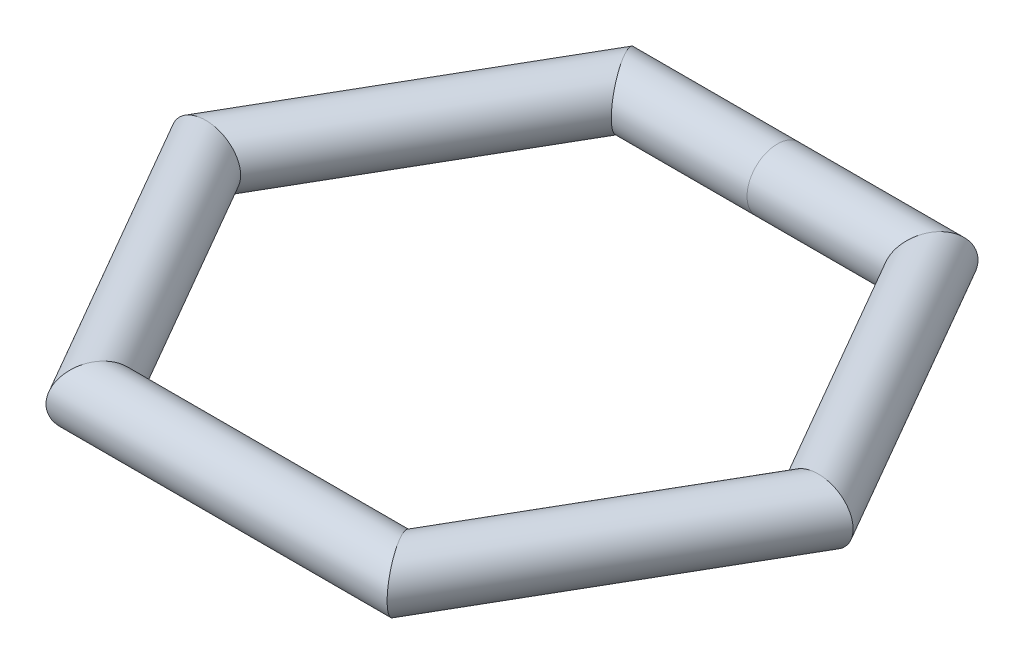
ISO-10303-21;
HEADER;
FILE_DESCRIPTION(('STEP AP214'),'2;1');
FILE_NAME('part.step','',(''),(''),'','','');
FILE_SCHEMA(('AUTOMOTIVE_DESIGN { 1 0 10303 214 1 1 1 1 }'));
ENDSEC;
DATA;
#1=APPLICATION_CONTEXT('core data for automotive mechanical design processes');
#2=APPLICATION_PROTOCOL_DEFINITION('international standard','automotive_design',2000,#1);
#3=PRODUCT_CONTEXT('',#1,'mechanical');
#4=PRODUCT('Part','Part','',(#3));
#5=PRODUCT_RELATED_PRODUCT_CATEGORY('part','',(#4));
#6=PRODUCT_DEFINITION_FORMATION('','',#4);
#7=PRODUCT_DEFINITION_CONTEXT('part definition',#1,'design');
#8=PRODUCT_DEFINITION('design','',#6,#7);
#9=PRODUCT_DEFINITION_SHAPE('','',#8);
#10=(LENGTH_UNIT() NAMED_UNIT(*) SI_UNIT(.MILLI.,.METRE.));
#11=(NAMED_UNIT(*) PLANE_ANGLE_UNIT() SI_UNIT($,.RADIAN.));
#12=(NAMED_UNIT(*) SI_UNIT($,.STERADIAN.) SOLID_ANGLE_UNIT());
#13=UNCERTAINTY_MEASURE_WITH_UNIT(LENGTH_MEASURE(1.E-05),#10,'distance_accuracy_value','');
#14=(GEOMETRIC_REPRESENTATION_CONTEXT(3) GLOBAL_UNCERTAINTY_ASSIGNED_CONTEXT((#13)) GLOBAL_UNIT_ASSIGNED_CONTEXT((#10,
#11,#12)) REPRESENTATION_CONTEXT('',''));
#15=CARTESIAN_POINT('',(0.,0.,0.));
#16=DIRECTION('',(0.,0.,1.));
#17=DIRECTION('',(1.,0.,0.));
#18=AXIS2_PLACEMENT_3D('',#15,#16,#17);
#19=CARTESIAN_POINT('',(-38.4706617480043,0.,75.7243798637072));
#20=DIRECTION('',(-0.5,0.,-0.866025403784438));
#21=DIRECTION('',(-0.866025403784439,0.,0.5));
#22=AXIS2_PLACEMENT_3D('',#19,#20,#21);
#23=CYLINDRICAL_SURFACE('',#22,8.10730366782764);
#24=CARTESIAN_POINT('',(-41.0950764232666,0.,71.1787603060236));
#25=DIRECTION('',(-0.866025403784439,0.,-0.5));
#26=DIRECTION('',(-0.5,0.,0.866025403784439));
#27=AXIS2_PLACEMENT_3D('',#24,#25,#26);
#28=ELLIPSE('',#27,9.36150791004466,8.10730366782764);
#29=CARTESIAN_POINT('',(-45.7758303782889,0.,79.2860639738512));
#30=VERTEX_POINT('',#29);
#31=EDGE_CURVE('E64',#30,#30,#28,.F.);
#32=ORIENTED_EDGE('',*,*,#31,.F.);
#33=EDGE_LOOP('',(#32));
#34=FACE_BOUND('',#33,.T.);
#35=CARTESIAN_POINT('',(-82.1901528465331,0.,0.));
#36=DIRECTION('',(0.,0.,-1.));
#37=DIRECTION('',(1.,0.,0.));
#38=AXIS2_PLACEMENT_3D('',#35,#36,#37);
#39=ELLIPSE('',#38,9.36150791004466,8.10730366782764);
#40=CARTESIAN_POINT('',(-72.8286449364885,0.,0.));
#41=VERTEX_POINT('',#40);
#42=EDGE_CURVE('E40',#41,#41,#39,.F.);
#43=ORIENTED_EDGE('',*,*,#42,.T.);
#44=EDGE_LOOP('',(#43));
#45=FACE_BOUND('',#44,.T.);
#46=ADVANCED_FACE('F37',(#34,#45),#23,.T.);
#47=CARTESIAN_POINT('',(-84.8145675217954,0.,4.54561955768364));
#48=DIRECTION('',(0.5,0.,-0.866025403784439));
#49=DIRECTION('',(-0.866025403784439,0.,-0.5));
#50=AXIS2_PLACEMENT_3D('',#47,#48,#49);
#51=CYLINDRICAL_SURFACE('',#50,8.10730366782764);
#52=ORIENTED_EDGE('',*,*,#42,.F.);
#53=EDGE_LOOP('',(#52));
#54=FACE_BOUND('',#53,.T.);
#55=CARTESIAN_POINT('',(-41.0950764232666,0.,-71.1787603060236));
#56=DIRECTION('',(0.866025403784438,0.,-0.5));
#57=DIRECTION('',(0.5,0.,0.866025403784439));
#58=AXIS2_PLACEMENT_3D('',#55,#56,#57);
#59=ELLIPSE('',#58,9.36150791004466,8.10730366782764);
#60=CARTESIAN_POINT('',(-36.4143224682443,0.,-63.0714566381959));
#61=VERTEX_POINT('',#60);
#62=EDGE_CURVE('E57',#61,#61,#59,.F.);
#63=ORIENTED_EDGE('',*,*,#62,.T.);
#64=EDGE_LOOP('',(#63));
#65=FACE_BOUND('',#64,.T.);
#66=ADVANCED_FACE('F74',(#54,#65),#51,.T.);
#67=CARTESIAN_POINT('',(46.3439057737911,0.,71.1787603060236));
#68=DIRECTION('',(-1.,0.,0.));
#69=DIRECTION('',(0.,0.,1.));
#70=AXIS2_PLACEMENT_3D('',#67,#68,#69);
#71=CYLINDRICAL_SURFACE('',#70,8.10730366782764);
#72=CARTESIAN_POINT('',(41.0950764232666,0.,71.1787603060236));
#73=DIRECTION('',(-0.866025403784439,0.,0.5));
#74=DIRECTION('',(0.5,0.,0.866025403784439));
#75=AXIS2_PLACEMENT_3D('',#72,#73,#74);
#76=ELLIPSE('',#75,9.36150791004466,8.10730366782764);
#77=CARTESIAN_POINT('',(45.7758303782889,0.,79.2860639738512));
#78=VERTEX_POINT('',#77);
#79=EDGE_CURVE('E51',#78,#78,#76,.F.);
#80=ORIENTED_EDGE('',*,*,#79,.F.);
#81=EDGE_LOOP('',(#80));
#82=FACE_BOUND('',#81,.T.);
#83=ORIENTED_EDGE('',*,*,#31,.T.);
#84=EDGE_LOOP('',(#83));
#85=FACE_BOUND('',#84,.T.);
#86=ADVANCED_FACE('F77',(#82,#85),#71,.T.);
#87=CARTESIAN_POINT('',(-46.3439057737912,0.,-71.1787603060236));
#88=DIRECTION('',(1.,0.,0.));
#89=DIRECTION('',(0.,0.,-1.));
#90=AXIS2_PLACEMENT_3D('',#87,#88,#89);
#91=CYLINDRICAL_SURFACE('',#90,8.10730366782764);
#92=ORIENTED_EDGE('',*,*,#62,.F.);
#93=EDGE_LOOP('',(#92));
#94=FACE_BOUND('',#93,.T.);
#95=CARTESIAN_POINT('',(0.,0.,-71.1787603060236));
#96=DIRECTION('',(1.,0.,0.));
#97=DIRECTION('',(0.,0.,-1.));
#98=AXIS2_PLACEMENT_3D('',#95,#96,#97);
#99=CIRCLE('',#98,8.10730366782764);
#100=CARTESIAN_POINT('',(0.,0.,-79.2860639738512));
#101=VERTEX_POINT('',#100);
#102=EDGE_CURVE('E61',#101,#101,#99,.T.);
#103=ORIENTED_EDGE('',*,*,#102,.F.);
#104=EDGE_LOOP('',(#103));
#105=FACE_BOUND('',#104,.T.);
#106=ADVANCED_FACE('F80',(#94,#105),#91,.T.);
#107=CARTESIAN_POINT('',(0.,0.,-71.1787603060236));
#108=DIRECTION('',(1.,0.,0.));
#109=DIRECTION('',(0.,0.,-1.));
#110=AXIS2_PLACEMENT_3D('',#107,#108,#109);
#111=CYLINDRICAL_SURFACE('',#110,8.10730366782764);
#112=ORIENTED_EDGE('',*,*,#102,.T.);
#113=EDGE_LOOP('',(#112));
#114=FACE_BOUND('',#113,.T.);
#115=CARTESIAN_POINT('',(41.0950764232666,0.,-71.1787603060236));
#116=DIRECTION('',(0.866025403784439,0.,0.5));
#117=DIRECTION('',(-0.5,0.,0.866025403784439));
#118=AXIS2_PLACEMENT_3D('',#115,#116,#117);
#119=ELLIPSE('',#118,9.36150791004466,8.10730366782764);
#120=CARTESIAN_POINT('',(36.4143224682443,0.,-63.071456638196));
#121=VERTEX_POINT('',#120);
#122=EDGE_CURVE('E45',#121,#121,#119,.F.);
#123=ORIENTED_EDGE('',*,*,#122,.T.);
#124=EDGE_LOOP('',(#123));
#125=FACE_BOUND('',#124,.T.);
#126=ADVANCED_FACE('F83',(#114,#125),#111,.T.);
#127=CARTESIAN_POINT('',(84.8145675217954,0.,-4.54561955768365));
#128=DIRECTION('',(-0.5,0.,0.866025403784439));
#129=DIRECTION('',(0.866025403784439,0.,0.5));
#130=AXIS2_PLACEMENT_3D('',#127,#128,#129);
#131=CYLINDRICAL_SURFACE('',#130,8.10730366782764);
#132=CARTESIAN_POINT('',(82.1901528465331,0.,0.));
#133=DIRECTION('',(0.,0.,1.));
#134=DIRECTION('',(1.,0.,0.));
#135=AXIS2_PLACEMENT_3D('',#132,#133,#134);
#136=ELLIPSE('',#135,9.36150791004466,8.10730366782764);
#137=CARTESIAN_POINT('',(91.5516607565778,0.,0.));
#138=VERTEX_POINT('',#137);
#139=EDGE_CURVE('E10',#138,#138,#136,.F.);
#140=ORIENTED_EDGE('',*,*,#139,.F.);
#141=EDGE_LOOP('',(#140));
#142=FACE_BOUND('',#141,.T.);
#143=ORIENTED_EDGE('',*,*,#79,.T.);
#144=EDGE_LOOP('',(#143));
#145=FACE_BOUND('',#144,.T.);
#146=ADVANCED_FACE('F89',(#142,#145),#131,.T.);
#147=CARTESIAN_POINT('',(38.4706617480043,0.,-75.7243798637073));
#148=DIRECTION('',(0.5,0.,0.866025403784439));
#149=DIRECTION('',(0.866025403784439,0.,-0.5));
#150=AXIS2_PLACEMENT_3D('',#147,#148,#149);
#151=CYLINDRICAL_SURFACE('',#150,8.10730366782764);
#152=ORIENTED_EDGE('',*,*,#122,.F.);
#153=EDGE_LOOP('',(#152));
#154=FACE_BOUND('',#153,.T.);
#155=ORIENTED_EDGE('',*,*,#139,.T.);
#156=EDGE_LOOP('',(#155));
#157=FACE_BOUND('',#156,.T.);
#158=ADVANCED_FACE('F93',(#154,#157),#151,.T.);
#159=CLOSED_SHELL('',(#46,#66,#86,#106,#126,#146,#158));
#160=MANIFOLD_SOLID_BREP('B2',#159);
#161=ADVANCED_BREP_SHAPE_REPRESENTATION('',(#18,#160),#14);
#162=SHAPE_DEFINITION_REPRESENTATION(#9,#161);
ENDSEC;
END-ISO-10303-21;
